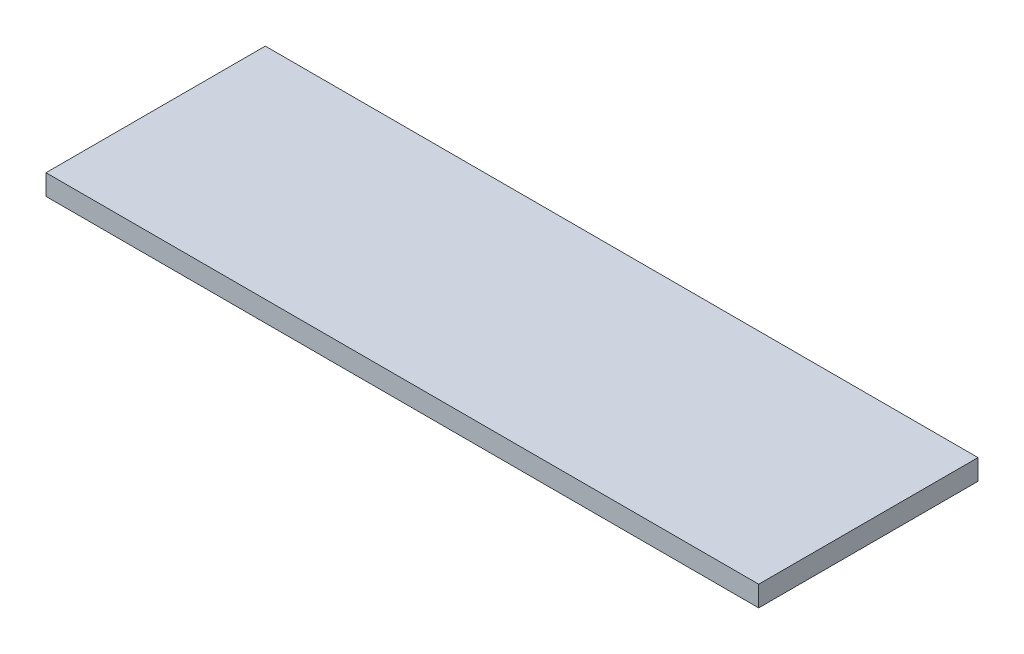
ISO-10303-21;
HEADER;
FILE_DESCRIPTION(('STEP AP214'),'2;1');
FILE_NAME('part.step','',(''),(''),'','','');
FILE_SCHEMA(('AUTOMOTIVE_DESIGN { 1 0 10303 214 1 1 1 1 }'));
ENDSEC;
DATA;
#1=APPLICATION_CONTEXT('core data for automotive mechanical design processes');
#2=APPLICATION_PROTOCOL_DEFINITION('international standard','automotive_design',2000,#1);
#3=PRODUCT_CONTEXT('',#1,'mechanical');
#4=PRODUCT('Part','Part','',(#3));
#5=PRODUCT_RELATED_PRODUCT_CATEGORY('part','',(#4));
#6=PRODUCT_DEFINITION_FORMATION('','',#4);
#7=PRODUCT_DEFINITION_CONTEXT('part definition',#1,'design');
#8=PRODUCT_DEFINITION('design','',#6,#7);
#9=PRODUCT_DEFINITION_SHAPE('','',#8);
#10=(LENGTH_UNIT() NAMED_UNIT(*) SI_UNIT(.MILLI.,.METRE.));
#11=(NAMED_UNIT(*) PLANE_ANGLE_UNIT() SI_UNIT($,.RADIAN.));
#12=(NAMED_UNIT(*) SI_UNIT($,.STERADIAN.) SOLID_ANGLE_UNIT());
#13=UNCERTAINTY_MEASURE_WITH_UNIT(LENGTH_MEASURE(1.E-05),#10,'distance_accuracy_value','');
#14=(GEOMETRIC_REPRESENTATION_CONTEXT(3) GLOBAL_UNCERTAINTY_ASSIGNED_CONTEXT((#13)) GLOBAL_UNIT_ASSIGNED_CONTEXT((#10,
#11,#12)) REPRESENTATION_CONTEXT('',''));
#15=CARTESIAN_POINT('',(0.,0.,0.));
#16=DIRECTION('',(0.,0.,1.));
#17=DIRECTION('',(1.,0.,0.));
#18=AXIS2_PLACEMENT_3D('',#15,#16,#17);
#19=CARTESIAN_POINT('',(0.,4.7625,0.));
#20=DIRECTION('',(1.,0.,0.));
#21=DIRECTION('',(0.,0.,-1.));
#22=AXIS2_PLACEMENT_3D('',#19,#20,#21);
#23=PLANE('',#22);
#24=DIRECTION('',(0.,0.,1.));
#25=VECTOR('',#24,1.);
#26=CARTESIAN_POINT('',(0.,0.,0.));
#27=LINE('',#26,#25);
#28=CARTESIAN_POINT('',(0.,0.,0.));
#29=VERTEX_POINT('',#28);
#30=CARTESIAN_POINT('',(0.,0.,50.8));
#31=VERTEX_POINT('',#30);
#32=EDGE_CURVE('E96',#29,#31,#27,.T.);
#33=ORIENTED_EDGE('',*,*,#32,.T.);
#34=DIRECTION('',(0.,-1.,0.));
#35=VECTOR('',#34,1.);
#36=CARTESIAN_POINT('',(0.,4.7625,50.8));
#37=LINE('',#36,#35);
#38=CARTESIAN_POINT('',(0.,4.7625,50.8));
#39=VERTEX_POINT('',#38);
#40=EDGE_CURVE('E11',#39,#31,#37,.T.);
#41=ORIENTED_EDGE('',*,*,#40,.F.);
#42=DIRECTION('',(0.,0.,1.));
#43=VECTOR('',#42,1.);
#44=CARTESIAN_POINT('',(0.,4.7625,0.));
#45=LINE('',#44,#43);
#46=CARTESIAN_POINT('',(0.,4.7625,0.));
#47=VERTEX_POINT('',#46);
#48=EDGE_CURVE('E82',#47,#39,#45,.T.);
#49=ORIENTED_EDGE('',*,*,#48,.F.);
#50=DIRECTION('',(0.,-1.,0.));
#51=VECTOR('',#50,1.);
#52=CARTESIAN_POINT('',(0.,4.7625,0.));
#53=LINE('',#52,#51);
#54=EDGE_CURVE('E49',#47,#29,#53,.T.);
#55=ORIENTED_EDGE('',*,*,#54,.T.);
#56=EDGE_LOOP('',(#33,#41,#49,#55));
#57=FACE_BOUND('',#56,.T.);
#58=ADVANCED_FACE('F33',(#57),#23,.F.);
#59=CARTESIAN_POINT('',(0.,4.7625,50.8));
#60=DIRECTION('',(0.,0.,-1.));
#61=DIRECTION('',(-1.,0.,0.));
#62=AXIS2_PLACEMENT_3D('',#59,#60,#61);
#63=PLANE('',#62);
#64=DIRECTION('',(1.,0.,0.));
#65=VECTOR('',#64,1.);
#66=CARTESIAN_POINT('',(0.,0.,50.8));
#67=LINE('',#66,#65);
#68=CARTESIAN_POINT('',(165.1,0.,50.8));
#69=VERTEX_POINT('',#68);
#70=EDGE_CURVE('E87',#31,#69,#67,.T.);
#71=ORIENTED_EDGE('',*,*,#70,.T.);
#72=DIRECTION('',(0.,-1.,0.));
#73=VECTOR('',#72,1.);
#74=CARTESIAN_POINT('',(165.1,4.7625,50.8));
#75=LINE('',#74,#73);
#76=CARTESIAN_POINT('',(165.1,4.7625,50.8));
#77=VERTEX_POINT('',#76);
#78=EDGE_CURVE('E41',#77,#69,#75,.T.);
#79=ORIENTED_EDGE('',*,*,#78,.F.);
#80=DIRECTION('',(1.,0.,0.));
#81=VECTOR('',#80,1.);
#82=CARTESIAN_POINT('',(0.,4.7625,50.8));
#83=LINE('',#82,#81);
#84=EDGE_CURVE('E74',#39,#77,#83,.T.);
#85=ORIENTED_EDGE('',*,*,#84,.F.);
#86=ORIENTED_EDGE('',*,*,#40,.T.);
#87=EDGE_LOOP('',(#71,#79,#85,#86));
#88=FACE_BOUND('',#87,.T.);
#89=ADVANCED_FACE('F86',(#88),#63,.F.);
#90=CARTESIAN_POINT('',(165.1,4.7625,0.));
#91=DIRECTION('',(1.,0.,0.));
#92=DIRECTION('',(0.,0.,-1.));
#93=AXIS2_PLACEMENT_3D('',#90,#91,#92);
#94=PLANE('',#93);
#95=DIRECTION('',(0.,0.,1.));
#96=VECTOR('',#95,1.);
#97=CARTESIAN_POINT('',(165.1,0.,0.));
#98=LINE('',#97,#96);
#99=CARTESIAN_POINT('',(165.1,0.,0.));
#100=VERTEX_POINT('',#99);
#101=EDGE_CURVE('E99',#100,#69,#98,.T.);
#102=ORIENTED_EDGE('',*,*,#101,.F.);
#103=DIRECTION('',(0.,-1.,0.));
#104=VECTOR('',#103,1.);
#105=CARTESIAN_POINT('',(165.1,4.7625,0.));
#106=LINE('',#105,#104);
#107=CARTESIAN_POINT('',(165.1,4.7625,0.));
#108=VERTEX_POINT('',#107);
#109=EDGE_CURVE('E63',#108,#100,#106,.T.);
#110=ORIENTED_EDGE('',*,*,#109,.F.);
#111=DIRECTION('',(0.,0.,1.));
#112=VECTOR('',#111,1.);
#113=CARTESIAN_POINT('',(165.1,4.7625,0.));
#114=LINE('',#113,#112);
#115=EDGE_CURVE('E81',#108,#77,#114,.T.);
#116=ORIENTED_EDGE('',*,*,#115,.T.);
#117=ORIENTED_EDGE('',*,*,#78,.T.);
#118=EDGE_LOOP('',(#102,#110,#116,#117));
#119=FACE_BOUND('',#118,.T.);
#120=ADVANCED_FACE('F90',(#119),#94,.T.);
#121=CARTESIAN_POINT('',(0.,4.7625,0.));
#122=DIRECTION('',(0.,0.,-1.));
#123=DIRECTION('',(-1.,0.,0.));
#124=AXIS2_PLACEMENT_3D('',#121,#122,#123);
#125=PLANE('',#124);
#126=DIRECTION('',(1.,0.,0.));
#127=VECTOR('',#126,1.);
#128=CARTESIAN_POINT('',(0.,0.,0.));
#129=LINE('',#128,#127);
#130=EDGE_CURVE('E101',#29,#100,#129,.T.);
#131=ORIENTED_EDGE('',*,*,#130,.F.);
#132=ORIENTED_EDGE('',*,*,#54,.F.);
#133=DIRECTION('',(1.,0.,0.));
#134=VECTOR('',#133,1.);
#135=CARTESIAN_POINT('',(0.,4.7625,0.));
#136=LINE('',#135,#134);
#137=EDGE_CURVE('E91',#47,#108,#136,.T.);
#138=ORIENTED_EDGE('',*,*,#137,.T.);
#139=ORIENTED_EDGE('',*,*,#109,.T.);
#140=EDGE_LOOP('',(#131,#132,#138,#139));
#141=FACE_BOUND('',#140,.T.);
#142=ADVANCED_FACE('F107',(#141),#125,.T.);
#143=CARTESIAN_POINT('',(0.,4.7625,0.));
#144=DIRECTION('',(0.,1.,0.));
#145=DIRECTION('',(0.,0.,1.));
#146=AXIS2_PLACEMENT_3D('',#143,#144,#145);
#147=PLANE('',#146);
#148=ORIENTED_EDGE('',*,*,#48,.T.);
#149=ORIENTED_EDGE('',*,*,#84,.T.);
#150=ORIENTED_EDGE('',*,*,#115,.F.);
#151=ORIENTED_EDGE('',*,*,#137,.F.);
#152=EDGE_LOOP('',(#148,#149,#150,#151));
#153=FACE_BOUND('',#152,.T.);
#154=ADVANCED_FACE('F78',(#153),#147,.T.);
#155=CARTESIAN_POINT('',(0.,0.,0.));
#156=DIRECTION('',(0.,1.,0.));
#157=DIRECTION('',(0.,0.,1.));
#158=AXIS2_PLACEMENT_3D('',#155,#156,#157);
#159=PLANE('',#158);
#160=ORIENTED_EDGE('',*,*,#32,.F.);
#161=ORIENTED_EDGE('',*,*,#130,.T.);
#162=ORIENTED_EDGE('',*,*,#101,.T.);
#163=ORIENTED_EDGE('',*,*,#70,.F.);
#164=EDGE_LOOP('',(#160,#161,#162,#163));
#165=FACE_BOUND('',#164,.T.);
#166=ADVANCED_FACE('F106',(#165),#159,.F.);
#167=CLOSED_SHELL('',(#58,#89,#120,#142,#154,#166));
#168=MANIFOLD_SOLID_BREP('B2',#167);
#169=ADVANCED_BREP_SHAPE_REPRESENTATION('',(#18,#168),#14);
#170=SHAPE_DEFINITION_REPRESENTATION(#9,#169);
ENDSEC;
END-ISO-10303-21;
